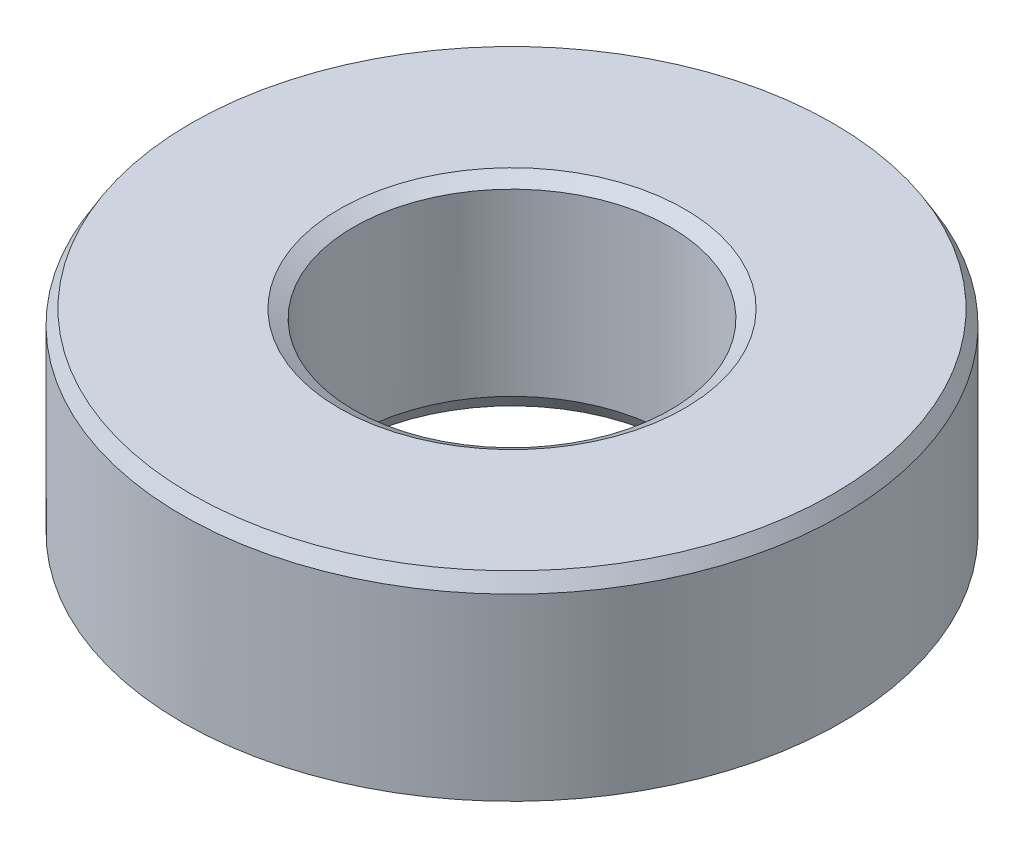
ISO-10303-21;
HEADER;
FILE_DESCRIPTION(('STEP AP214'),'2;1');
FILE_NAME('part.step','',(''),(''),'','','');
FILE_SCHEMA(('AUTOMOTIVE_DESIGN { 1 0 10303 214 1 1 1 1 }'));
ENDSEC;
DATA;
#1=APPLICATION_CONTEXT('core data for automotive mechanical design processes');
#2=APPLICATION_PROTOCOL_DEFINITION('international standard','automotive_design',2000,#1);
#3=PRODUCT_CONTEXT('',#1,'mechanical');
#4=PRODUCT('Part','Part','',(#3));
#5=PRODUCT_RELATED_PRODUCT_CATEGORY('part','',(#4));
#6=PRODUCT_DEFINITION_FORMATION('','',#4);
#7=PRODUCT_DEFINITION_CONTEXT('part definition',#1,'design');
#8=PRODUCT_DEFINITION('design','',#6,#7);
#9=PRODUCT_DEFINITION_SHAPE('','',#8);
#10=(LENGTH_UNIT() NAMED_UNIT(*) SI_UNIT(.MILLI.,.METRE.));
#11=(NAMED_UNIT(*) PLANE_ANGLE_UNIT() SI_UNIT($,.RADIAN.));
#12=(NAMED_UNIT(*) SI_UNIT($,.STERADIAN.) SOLID_ANGLE_UNIT());
#13=UNCERTAINTY_MEASURE_WITH_UNIT(LENGTH_MEASURE(1.E-05),#10,'distance_accuracy_value','');
#14=(GEOMETRIC_REPRESENTATION_CONTEXT(3) GLOBAL_UNCERTAINTY_ASSIGNED_CONTEXT((#13)) GLOBAL_UNIT_ASSIGNED_CONTEXT((#10,
#11,#12)) REPRESENTATION_CONTEXT('',''));
#15=CARTESIAN_POINT('',(0.,0.,0.));
#16=DIRECTION('',(0.,0.,1.));
#17=DIRECTION('',(1.,0.,0.));
#18=AXIS2_PLACEMENT_3D('',#15,#16,#17);
#19=CARTESIAN_POINT('',(0.,24.5373736838475,0.));
#20=DIRECTION('',(0.,-1.,0.));
#21=DIRECTION('',(0.,0.,-1.));
#22=AXIS2_PLACEMENT_3D('',#19,#20,#21);
#23=CYLINDRICAL_SURFACE('',#22,40.);
#24=CARTESIAN_POINT('',(0.,1.02696059376964,0.));
#25=DIRECTION('',(0.,1.,0.));
#26=DIRECTION('',(0.,0.,1.));
#27=AXIS2_PLACEMENT_3D('',#24,#25,#26);
#28=CIRCLE('',#27,40.);
#29=CARTESIAN_POINT('',(0.,1.02696059376964,-40.));
#30=VERTEX_POINT('',#29);
#31=EDGE_CURVE('E10',#30,#30,#28,.T.);
#32=CARTESIAN_POINT('',(0.,22.8065242204235,0.));
#33=DIRECTION('',(0.,1.,0.));
#34=DIRECTION('',(0.,0.,1.));
#35=AXIS2_PLACEMENT_3D('',#32,#33,#34);
#36=CIRCLE('',#35,40.);
#37=CARTESIAN_POINT('',(0.,22.8065242204235,-40.));
#38=VERTEX_POINT('',#37);
#39=EDGE_CURVE('E50',#38,#38,#36,.F.);
#40=CARTESIAN_POINT('',(0.,1.02696059376964,-40.));
#41=CARTESIAN_POINT('',(0.,1.25383104821395,-40.));
#42=CARTESIAN_POINT('',(0.,1.48070150265826,-40.));
#43=CARTESIAN_POINT('',(0.,1.93444241154688,-40.));
#44=CARTESIAN_POINT('',(0.,2.16131286599119,-40.));
#45=CARTESIAN_POINT('',(0.,2.61505377487981,-40.));
#46=CARTESIAN_POINT('',(0.,2.84192422932412,-40.));
#47=CARTESIAN_POINT('',(0.,3.29566513821275,-40.));
#48=CARTESIAN_POINT('',(0.,3.52253559265706,-40.));
#49=CARTESIAN_POINT('',(0.,3.97627650154568,-40.));
#50=CARTESIAN_POINT('',(0.,4.20314695598999,-40.));
#51=CARTESIAN_POINT('',(0.,4.65688786487861,-40.));
#52=CARTESIAN_POINT('',(0.,4.88375831932292,-40.));
#53=CARTESIAN_POINT('',(0.,5.33749922821154,-40.));
#54=CARTESIAN_POINT('',(0.,5.56436968265585,-40.));
#55=CARTESIAN_POINT('',(0.,6.01811059154448,-40.));
#56=CARTESIAN_POINT('',(0.,6.24498104598879,-40.));
#57=CARTESIAN_POINT('',(0.,6.69872195487741,-40.));
#58=CARTESIAN_POINT('',(0.,6.92559240932172,-40.));
#59=CARTESIAN_POINT('',(0.,7.37933331821034,-40.));
#60=CARTESIAN_POINT('',(0.,7.60620377265465,-40.));
#61=CARTESIAN_POINT('',(0.,8.05994468154327,-40.));
#62=CARTESIAN_POINT('',(0.,8.28681513598758,-40.));
#63=CARTESIAN_POINT('',(0.,8.7405560448762,-40.));
#64=CARTESIAN_POINT('',(0.,8.96742649932051,-40.));
#65=CARTESIAN_POINT('',(0.,9.42116740820913,-40.));
#66=CARTESIAN_POINT('',(0.,9.64803786265345,-40.));
#67=CARTESIAN_POINT('',(0.,10.1017787715421,-40.));
#68=CARTESIAN_POINT('',(0.,10.3286492259864,-40.));
#69=CARTESIAN_POINT('',(0.,10.782390134875,-40.));
#70=CARTESIAN_POINT('',(0.,11.0092605893193,-40.));
#71=CARTESIAN_POINT('',(0.,11.4630014982079,-40.));
#72=CARTESIAN_POINT('',(0.,11.6898719526522,-40.));
#73=CARTESIAN_POINT('',(0.,12.1436128615409,-40.));
#74=CARTESIAN_POINT('',(0.,12.3704833159852,-40.));
#75=CARTESIAN_POINT('',(0.,12.8242242248738,-40.));
#76=CARTESIAN_POINT('',(0.,13.0510946793181,-40.));
#77=CARTESIAN_POINT('',(0.,13.5048355882067,-40.));
#78=CARTESIAN_POINT('',(0.,13.731706042651,-40.));
#79=CARTESIAN_POINT('',(0.,14.1854469515397,-40.));
#80=CARTESIAN_POINT('',(0.,14.412317405984,-40.));
#81=CARTESIAN_POINT('',(0.,14.8660583148726,-40.));
#82=CARTESIAN_POINT('',(0.,15.0929287693169,-40.));
#83=CARTESIAN_POINT('',(0.,15.5466696782055,-40.));
#84=CARTESIAN_POINT('',(0.,15.7735401326498,-40.));
#85=CARTESIAN_POINT('',(0.,16.2272810415385,-40.));
#86=CARTESIAN_POINT('',(0.,16.4541514959828,-40.));
#87=CARTESIAN_POINT('',(0.,16.9078924048714,-40.));
#88=CARTESIAN_POINT('',(0.,17.1347628593157,-40.));
#89=CARTESIAN_POINT('',(0.,17.5885037682043,-40.));
#90=CARTESIAN_POINT('',(0.,17.8153742226486,-40.));
#91=CARTESIAN_POINT('',(0.,18.2691151315373,-40.));
#92=CARTESIAN_POINT('',(0.,18.4959855859816,-40.));
#93=CARTESIAN_POINT('',(0.,18.9497264948702,-40.));
#94=CARTESIAN_POINT('',(0.,19.1765969493145,-40.));
#95=CARTESIAN_POINT('',(0.,19.6303378582031,-40.));
#96=CARTESIAN_POINT('',(0.,19.8572083126474,-40.));
#97=CARTESIAN_POINT('',(0.,20.3109492215361,-40.));
#98=CARTESIAN_POINT('',(0.,20.5378196759804,-40.));
#99=CARTESIAN_POINT('',(0.,20.991560584869,-40.));
#100=CARTESIAN_POINT('',(0.,21.2184310393133,-40.));
#101=CARTESIAN_POINT('',(0.,21.6721719482019,-40.));
#102=CARTESIAN_POINT('',(0.,21.8990424026462,-40.));
#103=CARTESIAN_POINT('',(0.,22.3527833115348,-40.));
#104=CARTESIAN_POINT('',(0.,22.5796537659792,-40.));
#105=CARTESIAN_POINT('',(0.,22.8065242204235,-40.));
#106=B_SPLINE_CURVE_WITH_KNOTS('',3,(#40,#41,#42,#43,#44,#45,#46,#47,#48,#49,#50,#51,#52,#53,
#54,#55,#56,#57,#58,#59,#60,#61,#62,#63,#64,#65,#66,#67,#68,#69,#70,#71,#72,#73,#74,#75,#76,#77,
#78,#79,#80,#81,#82,#83,#84,#85,#86,#87,#88,#89,#90,#91,#92,#93,#94,#95,#96,#97,#98,#99,#100,
#101,#102,#103,#104,#105),.UNSPECIFIED.,.F.,.F.,(4,2,2,2,2,2,2,2,2,2,2,2,2,2,2,2,2,2,2,2,2,2,2,
2,2,2,2,2,2,2,2,2,4),(0.,0.680611363332931,1.36122272666587,2.0418340899988,2.72244545333173,
3.40305681666466,4.08366817999759,4.76427954333053,5.44489090666346,6.12550226999639,
6.80611363332932,7.48672499666226,8.16733635999519,8.84794772332812,9.52855908666105,
10.209170449994,10.8897818133269,11.5703931766598,12.2510045399928,12.9316159033257,
13.6122272666586,14.2928386299916,14.9734499933245,15.6540613566574,16.3346727199904,
17.0152840833233,17.6958954466562,18.3765068099892,19.0571181733221,19.737729536655,
20.418340899988,21.0989522633209,21.7795636266538),.UNSPECIFIED.);
#107=EDGE_CURVE('BSEAM39',#30,#38,#106,.T.);
#108=ORIENTED_EDGE('',*,*,#31,.T.);
#109=ORIENTED_EDGE('',*,*,#39,.T.);
#110=ORIENTED_EDGE('',*,*,#107,.T.);
#111=ORIENTED_EDGE('',*,*,#107,.F.);
#112=EDGE_LOOP('',(#108,#110,#109,#111));
#113=FACE_BOUND('',#112,.T.);
#114=ADVANCED_FACE('F39',(#113),#23,.T.);
#115=CARTESIAN_POINT('',(0.,24.5373736838475,0.));
#116=DIRECTION('',(0.,1.,0.));
#117=DIRECTION('',(0.,0.,1.));
#118=AXIS2_PLACEMENT_3D('',#115,#116,#117);
#119=PLANE('',#118);
#120=CARTESIAN_POINT('',(0.,24.5373736838475,0.));
#121=DIRECTION('',(0.,1.,0.));
#122=DIRECTION('',(0.,0.,1.));
#123=AXIS2_PLACEMENT_3D('',#120,#121,#122);
#124=CIRCLE('',#123,20.9534683511891);
#125=CARTESIAN_POINT('',(0.,24.5373736838475,20.9534683511891));
#126=VERTEX_POINT('',#125);
#127=EDGE_CURVE('E58',#126,#126,#124,.F.);
#128=ORIENTED_EDGE('',*,*,#127,.T.);
#129=EDGE_LOOP('',(#128));
#130=FACE_BOUND('',#129,.T.);
#131=CARTESIAN_POINT('',(0.,24.5373736838475,0.));
#132=DIRECTION('',(0.,1.,0.));
#133=DIRECTION('',(0.,0.,1.));
#134=AXIS2_PLACEMENT_3D('',#131,#132,#133);
#135=CIRCLE('',#134,38.9730394062305);
#136=CARTESIAN_POINT('',(0.,24.5373736838475,38.9730394062305));
#137=VERTEX_POINT('',#136);
#138=EDGE_CURVE('E61',#137,#137,#135,.T.);
#139=ORIENTED_EDGE('',*,*,#138,.T.);
#140=EDGE_LOOP('',(#139));
#141=FACE_BOUND('',#140,.T.);
#142=ADVANCED_FACE('F88',(#130,#141),#119,.T.);
#143=CARTESIAN_POINT('',(0.,0.,0.));
#144=DIRECTION('',(0.,1.,0.));
#145=DIRECTION('',(0.,0.,1.));
#146=AXIS2_PLACEMENT_3D('',#143,#144,#145);
#147=PLANE('',#146);
#148=CARTESIAN_POINT('',(0.,0.,0.));
#149=DIRECTION('',(0.,1.,0.));
#150=DIRECTION('',(0.,0.,1.));
#151=AXIS2_PLACEMENT_3D('',#148,#149,#150);
#152=CIRCLE('',#151,20.2495794815345);
#153=CARTESIAN_POINT('',(0.,0.,20.2495794815345));
#154=VERTEX_POINT('',#153);
#155=EDGE_CURVE('E51',#154,#154,#152,.T.);
#156=ORIENTED_EDGE('',*,*,#155,.T.);
#157=EDGE_LOOP('',(#156));
#158=FACE_BOUND('',#157,.T.);
#159=CARTESIAN_POINT('',(0.,0.,0.));
#160=DIRECTION('',(0.,1.,0.));
#161=DIRECTION('',(0.,0.,1.));
#162=AXIS2_PLACEMENT_3D('',#159,#160,#161);
#163=CIRCLE('',#162,38.2691505365757);
#164=CARTESIAN_POINT('',(0.,0.,38.2691505365757));
#165=VERTEX_POINT('',#164);
#166=EDGE_CURVE('E54',#165,#165,#163,.F.);
#167=ORIENTED_EDGE('',*,*,#166,.T.);
#168=EDGE_LOOP('',(#167));
#169=FACE_BOUND('',#168,.T.);
#170=ADVANCED_FACE('F83',(#158,#169),#147,.F.);
#171=CARTESIAN_POINT('',(0.,24.5373736838475,0.));
#172=DIRECTION('',(0.,-1.,0.));
#173=DIRECTION('',(0.,0.,-1.));
#174=AXIS2_PLACEMENT_3D('',#171,#172,#173);
#175=CYLINDRICAL_SURFACE('',#174,19.2226188877649);
#176=CARTESIAN_POINT('',(0.,23.5104130900779,0.));
#177=DIRECTION('',(0.,1.,0.));
#178=DIRECTION('',(0.,0.,1.));
#179=AXIS2_PLACEMENT_3D('',#176,#177,#178);
#180=CIRCLE('',#179,19.2226188877649);
#181=CARTESIAN_POINT('',(0.,23.5104130900779,-19.2226188877649));
#182=VERTEX_POINT('',#181);
#183=EDGE_CURVE('E67',#182,#182,#180,.T.);
#184=CARTESIAN_POINT('',(0.,1.73084946342412,0.));
#185=DIRECTION('',(0.,1.,0.));
#186=DIRECTION('',(0.,0.,1.));
#187=AXIS2_PLACEMENT_3D('',#184,#185,#186);
#188=CIRCLE('',#187,19.2226188877649);
#189=CARTESIAN_POINT('',(0.,1.73084946342412,-19.2226188877649));
#190=VERTEX_POINT('',#189);
#191=EDGE_CURVE('E69',#190,#190,#188,.F.);
#192=CARTESIAN_POINT('',(0.,23.5104130900779,-19.2226188877649));
#193=CARTESIAN_POINT('',(0.,23.2835426356336,-19.2226188877649));
#194=CARTESIAN_POINT('',(0.,23.0566721811892,-19.2226188877649));
#195=CARTESIAN_POINT('',(0.,22.6029312723006,-19.2226188877649));
#196=CARTESIAN_POINT('',(0.,22.3760608178563,-19.2226188877649));
#197=CARTESIAN_POINT('',(0.,21.9223199089677,-19.2226188877649));
#198=CARTESIAN_POINT('',(0.,21.6954494545234,-19.2226188877649));
#199=CARTESIAN_POINT('',(0.,21.2417085456348,-19.2226188877649));
#200=CARTESIAN_POINT('',(0.,21.0148380911904,-19.2226188877649));
#201=CARTESIAN_POINT('',(0.,20.5610971823018,-19.2226188877649));
#202=CARTESIAN_POINT('',(0.,20.3342267278575,-19.2226188877649));
#203=CARTESIAN_POINT('',(0.,19.8804858189689,-19.2226188877649));
#204=CARTESIAN_POINT('',(0.,19.6536153645246,-19.2226188877649));
#205=CARTESIAN_POINT('',(0.,19.199874455636,-19.2226188877649));
#206=CARTESIAN_POINT('',(0.,18.9730040011917,-19.2226188877649));
#207=CARTESIAN_POINT('',(0.,18.519263092303,-19.2226188877649));
#208=CARTESIAN_POINT('',(0.,18.2923926378587,-19.2226188877649));
#209=CARTESIAN_POINT('',(0.,17.8386517289701,-19.2226188877649));
#210=CARTESIAN_POINT('',(0.,17.6117812745258,-19.2226188877649));
#211=CARTESIAN_POINT('',(0.,17.1580403656372,-19.2226188877649));
#212=CARTESIAN_POINT('',(0.,16.9311699111929,-19.2226188877649));
#213=CARTESIAN_POINT('',(0.,16.4774290023043,-19.2226188877649));
#214=CARTESIAN_POINT('',(0.,16.2505585478599,-19.2226188877649));
#215=CARTESIAN_POINT('',(0.,15.7968176389713,-19.2226188877649));
#216=CARTESIAN_POINT('',(0.,15.569947184527,-19.2226188877649));
#217=CARTESIAN_POINT('',(0.,15.1162062756384,-19.2226188877649));
#218=CARTESIAN_POINT('',(0.,14.8893358211941,-19.2226188877649));
#219=CARTESIAN_POINT('',(0.,14.4355949123055,-19.2226188877649));
#220=CARTESIAN_POINT('',(0.,14.2087244578612,-19.2226188877649));
#221=CARTESIAN_POINT('',(0.,13.7549835489725,-19.2226188877649));
#222=CARTESIAN_POINT('',(0.,13.5281130945282,-19.2226188877649));
#223=CARTESIAN_POINT('',(0.,13.0743721856396,-19.2226188877649));
#224=CARTESIAN_POINT('',(0.,12.8475017311953,-19.2226188877649));
#225=CARTESIAN_POINT('',(0.,12.3937608223067,-19.2226188877649));
#226=CARTESIAN_POINT('',(0.,12.1668903678624,-19.2226188877649));
#227=CARTESIAN_POINT('',(0.,11.7131494589737,-19.2226188877649));
#228=CARTESIAN_POINT('',(0.,11.4862790045294,-19.2226188877649));
#229=CARTESIAN_POINT('',(0.,11.0325380956408,-19.2226188877649));
#230=CARTESIAN_POINT('',(0.,10.8056676411965,-19.2226188877649));
#231=CARTESIAN_POINT('',(0.,10.3519267323079,-19.2226188877649));
#232=CARTESIAN_POINT('',(0.,10.1250562778636,-19.2226188877649));
#233=CARTESIAN_POINT('',(0.,9.67131536897496,-19.2226188877649));
#234=CARTESIAN_POINT('',(0.,9.44444491453065,-19.2226188877649));
#235=CARTESIAN_POINT('',(0.,8.99070400564203,-19.2226188877649));
#236=CARTESIAN_POINT('',(0.,8.76383355119772,-19.2226188877649));
#237=CARTESIAN_POINT('',(0.,8.3100926423091,-19.2226188877649));
#238=CARTESIAN_POINT('',(0.,8.08322218786479,-19.2226188877649));
#239=CARTESIAN_POINT('',(0.,7.62948127897617,-19.2226188877649));
#240=CARTESIAN_POINT('',(0.,7.40261082453186,-19.2226188877649));
#241=CARTESIAN_POINT('',(0.,6.94886991564324,-19.2226188877649));
#242=CARTESIAN_POINT('',(0.,6.72199946119893,-19.2226188877649));
#243=CARTESIAN_POINT('',(0.,6.26825855231031,-19.2226188877649));
#244=CARTESIAN_POINT('',(0.,6.041388097866,-19.2226188877649));
#245=CARTESIAN_POINT('',(0.,5.58764718897739,-19.2226188877649));
#246=CARTESIAN_POINT('',(0.,5.36077673453308,-19.2226188877649));
#247=CARTESIAN_POINT('',(0.,4.90703582564446,-19.2226188877649));
#248=CARTESIAN_POINT('',(0.,4.68016537120014,-19.2226188877649));
#249=CARTESIAN_POINT('',(0.,4.22642446231152,-19.2226188877649));
#250=CARTESIAN_POINT('',(0.,3.99955400786721,-19.2226188877649));
#251=CARTESIAN_POINT('',(0.,3.54581309897859,-19.2226188877649));
#252=CARTESIAN_POINT('',(0.,3.31894264453428,-19.2226188877649));
#253=CARTESIAN_POINT('',(0.,2.86520173564567,-19.2226188877649));
#254=CARTESIAN_POINT('',(0.,2.63833128120136,-19.2226188877649));
#255=CARTESIAN_POINT('',(0.,2.18459037231274,-19.2226188877649));
#256=CARTESIAN_POINT('',(0.,1.95771991786843,-19.2226188877649));
#257=CARTESIAN_POINT('',(0.,1.73084946342412,-19.2226188877649));
#258=B_SPLINE_CURVE_WITH_KNOTS('',3,(#192,#193,#194,#195,#196,#197,#198,#199,#200,#201,#202,
#203,#204,#205,#206,#207,#208,#209,#210,#211,#212,#213,#214,#215,#216,#217,#218,#219,#220,#221,
#222,#223,#224,#225,#226,#227,#228,#229,#230,#231,#232,#233,#234,#235,#236,#237,#238,#239,#240,
#241,#242,#243,#244,#245,#246,#247,#248,#249,#250,#251,#252,#253,#254,#255,#256,#257),
.UNSPECIFIED.,.F.,.F.,(4,2,2,2,2,2,2,2,2,2,2,2,2,2,2,2,2,2,2,2,2,2,2,2,2,2,2,2,2,2,2,2,4),(0.,
0.680611363332931,1.36122272666586,2.04183408999879,2.72244545333172,3.40305681666465,
4.08366817999758,4.76427954333051,5.44489090666344,6.12550226999637,6.8061136333293,
7.48672499666223,8.16733635999515,8.84794772332808,9.52855908666101,10.2091704499939,
10.8897818133269,11.5703931766598,12.2510045399927,12.9316159033257,13.6122272666586,
14.2928386299915,14.9734499933244,15.6540613566574,16.3346727199903,17.0152840833232,
17.6958954466562,18.3765068099891,19.057118173322,19.737729536655,20.4183408999879,
21.0989522633208,21.7795636266537),.UNSPECIFIED.);
#259=EDGE_CURVE('BSEAM71',#182,#190,#258,.T.);
#260=ORIENTED_EDGE('',*,*,#183,.T.);
#261=ORIENTED_EDGE('',*,*,#191,.T.);
#262=ORIENTED_EDGE('',*,*,#259,.T.);
#263=ORIENTED_EDGE('',*,*,#259,.F.);
#264=EDGE_LOOP('',(#260,#262,#261,#263));
#265=FACE_BOUND('',#264,.T.);
#266=ADVANCED_FACE('F71',(#265),#175,.F.);
#267=CARTESIAN_POINT('',(0.,23.5104130900779,0.));
#268=DIRECTION('',(0.,1.,0.));
#269=DIRECTION('',(0.,0.,1.));
#270=AXIS2_PLACEMENT_3D('',#267,#268,#269);
#271=CONICAL_SURFACE('',#270,19.2226188877649,1.03529751848025);
#272=ORIENTED_EDGE('',*,*,#127,.F.);
#273=EDGE_LOOP('',(#272));
#274=FACE_BOUND('',#273,.T.);
#275=ORIENTED_EDGE('',*,*,#183,.F.);
#276=EDGE_LOOP('',(#275));
#277=FACE_BOUND('',#276,.T.);
#278=ADVANCED_FACE('F77',(#274,#277),#271,.F.);
#279=CARTESIAN_POINT('',(0.,0.,0.));
#280=DIRECTION('',(0.,-1.,0.));
#281=DIRECTION('',(0.,0.,-1.));
#282=AXIS2_PLACEMENT_3D('',#279,#280,#281);
#283=CONICAL_SURFACE('',#282,20.2495794815345,0.535498808314652);
#284=ORIENTED_EDGE('',*,*,#191,.F.);
#285=EDGE_LOOP('',(#284));
#286=FACE_BOUND('',#285,.T.);
#287=ORIENTED_EDGE('',*,*,#155,.F.);
#288=EDGE_LOOP('',(#287));
#289=FACE_BOUND('',#288,.T.);
#290=ADVANCED_FACE('F73',(#286,#289),#283,.F.);
#291=CARTESIAN_POINT('',(0.,1.02696059376964,0.));
#292=DIRECTION('',(0.,1.,0.));
#293=DIRECTION('',(0.,0.,1.));
#294=AXIS2_PLACEMENT_3D('',#291,#292,#293);
#295=CONICAL_SURFACE('',#294,40.,1.03529751848025);
#296=ORIENTED_EDGE('',*,*,#166,.F.);
#297=EDGE_LOOP('',(#296));
#298=FACE_BOUND('',#297,.T.);
#299=ORIENTED_EDGE('',*,*,#31,.F.);
#300=EDGE_LOOP('',(#299));
#301=FACE_BOUND('',#300,.T.);
#302=ADVANCED_FACE('F76',(#298,#301),#295,.T.);
#303=CARTESIAN_POINT('',(0.,24.5373736838475,0.));
#304=DIRECTION('',(0.,-1.,0.));
#305=DIRECTION('',(0.,0.,-1.));
#306=AXIS2_PLACEMENT_3D('',#303,#304,#305);
#307=CONICAL_SURFACE('',#306,38.9730394062305,0.535498808314651);
#308=ORIENTED_EDGE('',*,*,#39,.F.);
#309=EDGE_LOOP('',(#308));
#310=FACE_BOUND('',#309,.T.);
#311=ORIENTED_EDGE('',*,*,#138,.F.);
#312=EDGE_LOOP('',(#311));
#313=FACE_BOUND('',#312,.T.);
#314=ADVANCED_FACE('F45',(#310,#313),#307,.T.);
#315=CLOSED_SHELL('',(#114,#142,#170,#266,#278,#290,#302,#314));
#316=MANIFOLD_SOLID_BREP('B2',#315);
#317=ADVANCED_BREP_SHAPE_REPRESENTATION('',(#18,#316),#14);
#318=SHAPE_DEFINITION_REPRESENTATION(#9,#317);
ENDSEC;
END-ISO-10303-21;
